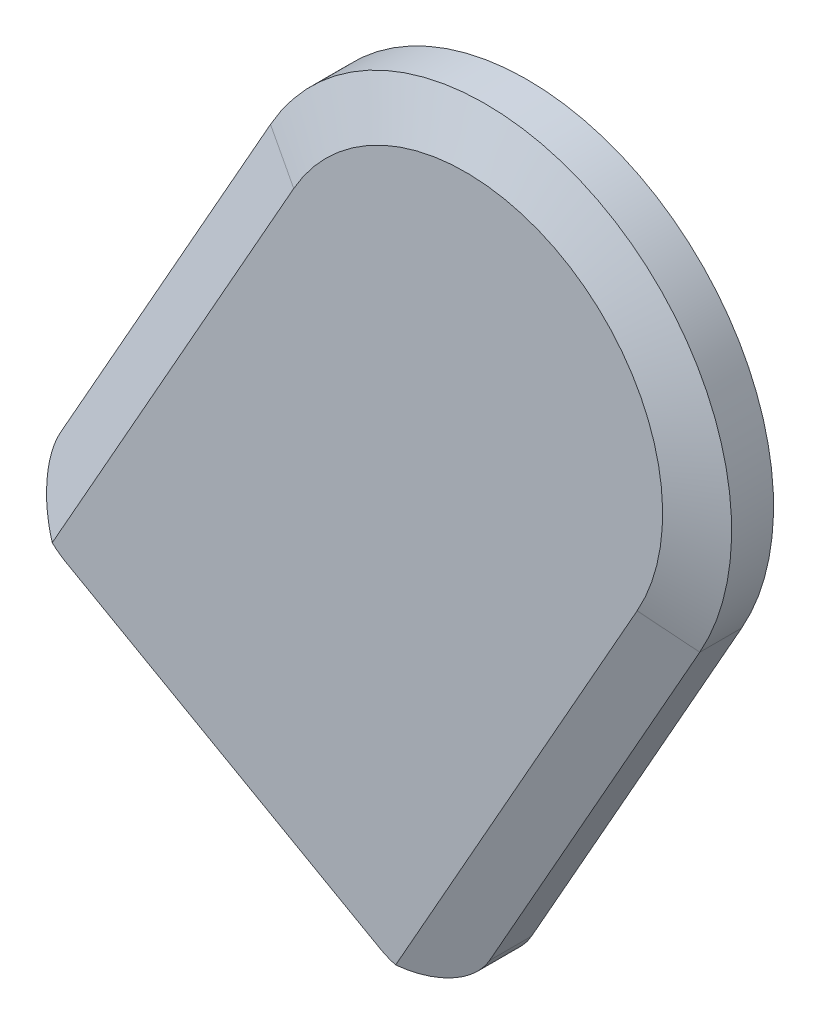
ISO-10303-21;
HEADER;
FILE_DESCRIPTION(('STEP AP214'),'2;1');
FILE_NAME('part.step','',(''),(''),'','','');
FILE_SCHEMA(('AUTOMOTIVE_DESIGN { 1 0 10303 214 1 1 1 1 }'));
ENDSEC;
DATA;
#1=APPLICATION_CONTEXT('core data for automotive mechanical design processes');
#2=APPLICATION_PROTOCOL_DEFINITION('international standard','automotive_design',2000,#1);
#3=PRODUCT_CONTEXT('',#1,'mechanical');
#4=PRODUCT('Part','Part','',(#3));
#5=PRODUCT_RELATED_PRODUCT_CATEGORY('part','',(#4));
#6=PRODUCT_DEFINITION_FORMATION('','',#4);
#7=PRODUCT_DEFINITION_CONTEXT('part definition',#1,'design');
#8=PRODUCT_DEFINITION('design','',#6,#7);
#9=PRODUCT_DEFINITION_SHAPE('','',#8);
#10=(LENGTH_UNIT() NAMED_UNIT(*) SI_UNIT(.MILLI.,.METRE.));
#11=(NAMED_UNIT(*) PLANE_ANGLE_UNIT() SI_UNIT($,.RADIAN.));
#12=(NAMED_UNIT(*) SI_UNIT($,.STERADIAN.) SOLID_ANGLE_UNIT());
#13=UNCERTAINTY_MEASURE_WITH_UNIT(LENGTH_MEASURE(1.E-05),#10,'distance_accuracy_value','');
#14=(GEOMETRIC_REPRESENTATION_CONTEXT(3) GLOBAL_UNCERTAINTY_ASSIGNED_CONTEXT((#13)) GLOBAL_UNIT_ASSIGNED_CONTEXT((#10,
#11,#12)) REPRESENTATION_CONTEXT('',''));
#15=CARTESIAN_POINT('',(0.,0.,0.));
#16=DIRECTION('',(0.,0.,1.));
#17=DIRECTION('',(1.,0.,0.));
#18=AXIS2_PLACEMENT_3D('',#15,#16,#17);
#19=CARTESIAN_POINT('',(0.,0.,4.7625));
#20=DIRECTION('',(0.,0.,-1.));
#21=DIRECTION('',(-1.,0.,0.));
#22=AXIS2_PLACEMENT_3D('',#19,#20,#21);
#23=CYLINDRICAL_SURFACE('',#22,19.05);
#24=DIRECTION('',(0.,0.,-1.));
#25=VECTOR('',#24,1.);
#26=CARTESIAN_POINT('',(-16.5860934980668,9.37037899304964,4.7625));
#27=LINE('',#26,#25);
#28=CARTESIAN_POINT('',(-16.5860934980668,9.37037899304964,3.2385));
#29=VERTEX_POINT('',#28);
#30=CARTESIAN_POINT('',(-16.5860934980668,9.37037899304964,0.));
#31=VERTEX_POINT('',#30);
#32=EDGE_CURVE('E107',#29,#31,#27,.T.);
#33=ORIENTED_EDGE('',*,*,#32,.F.);
#34=CARTESIAN_POINT('',(0.,0.,3.2385));
#35=DIRECTION('',(0.,0.,1.));
#36=DIRECTION('',(1.,0.,0.));
#37=AXIS2_PLACEMENT_3D('',#34,#35,#36);
#38=CIRCLE('',#37,19.05);
#39=CARTESIAN_POINT('',(16.5860934980668,-9.37037899304964,3.2385));
#40=VERTEX_POINT('',#39);
#41=EDGE_CURVE('E165',#29,#40,#38,.F.);
#42=ORIENTED_EDGE('',*,*,#41,.T.);
#43=DIRECTION('',(0.,0.,-1.));
#44=VECTOR('',#43,1.);
#45=CARTESIAN_POINT('',(16.5860934980668,-9.37037899304964,4.7625));
#46=LINE('',#45,#44);
#47=CARTESIAN_POINT('',(16.5860934980668,-9.37037899304964,0.));
#48=VERTEX_POINT('',#47);
#49=EDGE_CURVE('E119',#40,#48,#46,.T.);
#50=ORIENTED_EDGE('',*,*,#49,.T.);
#51=CARTESIAN_POINT('',(0.,0.,0.));
#52=DIRECTION('',(0.,0.,1.));
#53=DIRECTION('',(1.,0.,0.));
#54=AXIS2_PLACEMENT_3D('',#51,#52,#53);
#55=CIRCLE('',#54,19.05);
#56=EDGE_CURVE('E126',#48,#31,#55,.T.);
#57=ORIENTED_EDGE('',*,*,#56,.T.);
#58=EDGE_LOOP('',(#33,#42,#50,#57));
#59=FACE_BOUND('',#58,.T.);
#60=ADVANCED_FACE('F41',(#59),#23,.T.);
#61=CARTESIAN_POINT('',(-16.5860934980668,9.37037899304964,4.7625));
#62=DIRECTION('',(0.870661076014006,-0.491883411708642,0.));
#63=DIRECTION('',(0.491883411708642,0.870661076014006,0.));
#64=AXIS2_PLACEMENT_3D('',#61,#62,#63);
#65=PLANE('',#64);
#66=DIRECTION('',(-0.491883411708642,-0.870661076014006,0.));
#67=VECTOR('',#66,1.);
#68=CARTESIAN_POINT('',(-16.5860934980668,9.37037899304964,0.));
#69=LINE('',#68,#67);
#70=CARTESIAN_POINT('',(-32.8280837526862,-19.3788497369328,0.));
#71=VERTEX_POINT('',#70);
#72=EDGE_CURVE('E110',#31,#71,#69,.T.);
#73=ORIENTED_EDGE('',*,*,#72,.T.);
#74=DIRECTION('',(0.,0.,-1.));
#75=VECTOR('',#74,1.);
#76=CARTESIAN_POINT('',(-32.8280837526862,-19.3788497369328,4.7625));
#77=LINE('',#76,#75);
#78=CARTESIAN_POINT('',(-32.8280837526862,-19.3788497369328,3.2385));
#79=VERTEX_POINT('',#78);
#80=EDGE_CURVE('E183',#71,#79,#77,.F.);
#81=ORIENTED_EDGE('',*,*,#80,.T.);
#82=DIRECTION('',(0.491883411708642,0.870661076014006,0.));
#83=VECTOR('',#82,1.);
#84=CARTESIAN_POINT('',(-16.5860934980668,9.37037899304964,3.2385));
#85=LINE('',#84,#83);
#86=EDGE_CURVE('E113',#79,#29,#85,.T.);
#87=ORIENTED_EDGE('',*,*,#86,.T.);
#88=ORIENTED_EDGE('',*,*,#32,.T.);
#89=EDGE_LOOP('',(#73,#81,#87,#88));
#90=FACE_BOUND('',#89,.T.);
#91=ADVANCED_FACE('F109',(#90),#65,.F.);
#92=CARTESIAN_POINT('',(-35.3268514841661,-23.801808003084,4.7625));
#93=DIRECTION('',(0.491883411708639,0.870661076014008,0.));
#94=DIRECTION('',(-0.870661076014008,0.491883411708639,0.));
#95=AXIS2_PLACEMENT_3D('',#92,#93,#94);
#96=PLANE('',#95);
#97=DIRECTION('',(0.870661076014008,-0.491883411708639,0.));
#98=VECTOR('',#97,1.);
#99=CARTESIAN_POINT('',(-35.3268514841661,-23.801808003084,4.7625));
#100=LINE('',#99,#98);
#101=CARTESIAN_POINT('',(-30.9038932180149,-26.3005757345639,4.7625));
#102=VERTEX_POINT('',#101);
#103=CARTESIAN_POINT('',(-6.57762275418354,-40.0437982577033,4.7625));
#104=VERTEX_POINT('',#103);
#105=EDGE_CURVE('E141',#102,#104,#100,.T.);
#106=ORIENTED_EDGE('',*,*,#105,.F.);
#107=DIRECTION('',(0.,0.,-1.));
#108=VECTOR('',#107,1.);
#109=CARTESIAN_POINT('',(-30.9038932180149,-26.3005757345639,4.7625));
#110=LINE('',#109,#108);
#111=CARTESIAN_POINT('',(-30.9038932180149,-26.3005757345639,0.));
#112=VERTEX_POINT('',#111);
#113=EDGE_CURVE('E174',#102,#112,#110,.T.);
#114=ORIENTED_EDGE('',*,*,#113,.T.);
#115=DIRECTION('',(0.870661076014008,-0.491883411708639,0.));
#116=VECTOR('',#115,1.);
#117=CARTESIAN_POINT('',(-35.3268514841661,-23.801808003084,0.));
#118=LINE('',#117,#116);
#119=CARTESIAN_POINT('',(-6.57762275418354,-40.0437982577033,0.));
#120=VERTEX_POINT('',#119);
#121=EDGE_CURVE('E129',#112,#120,#118,.T.);
#122=ORIENTED_EDGE('',*,*,#121,.T.);
#123=DIRECTION('',(0.,0.,-1.));
#124=VECTOR('',#123,1.);
#125=CARTESIAN_POINT('',(-6.57762275418353,-40.0437982577033,4.7625));
#126=LINE('',#125,#124);
#127=EDGE_CURVE('E168',#120,#104,#126,.F.);
#128=ORIENTED_EDGE('',*,*,#127,.T.);
#129=EDGE_LOOP('',(#106,#114,#122,#128));
#130=FACE_BOUND('',#129,.T.);
#131=ADVANCED_FACE('F202',(#130),#96,.F.);
#132=CARTESIAN_POINT('',(16.5860934980668,-9.37037899304964,4.7625));
#133=DIRECTION('',(-0.870661076014006,0.491883411708642,0.));
#134=DIRECTION('',(-0.491883411708642,-0.870661076014006,0.));
#135=AXIS2_PLACEMENT_3D('',#132,#133,#134);
#136=PLANE('',#135);
#137=DIRECTION('',(-0.491883411708642,-0.870661076014006,0.));
#138=VECTOR('',#137,1.);
#139=CARTESIAN_POINT('',(-2.15466448803239,-42.5425659891831,3.2385));
#140=LINE('',#139,#138);
#141=CARTESIAN_POINT('',(0.344103243447504,-38.119607723032,3.2385));
#142=VERTEX_POINT('',#141);
#143=EDGE_CURVE('E160',#40,#142,#140,.T.);
#144=ORIENTED_EDGE('',*,*,#143,.T.);
#145=DIRECTION('',(0.,0.,-1.));
#146=VECTOR('',#145,1.);
#147=CARTESIAN_POINT('',(0.3441032434475,-38.119607723032,4.7625));
#148=LINE('',#147,#146);
#149=CARTESIAN_POINT('',(0.344103243447497,-38.119607723032,0.));
#150=VERTEX_POINT('',#149);
#151=EDGE_CURVE('E50',#142,#150,#148,.T.);
#152=ORIENTED_EDGE('',*,*,#151,.T.);
#153=DIRECTION('',(0.491883411708642,0.870661076014006,0.));
#154=VECTOR('',#153,1.);
#155=CARTESIAN_POINT('',(16.5860934980668,-9.37037899304964,0.));
#156=LINE('',#155,#154);
#157=EDGE_CURVE('E146',#150,#48,#156,.T.);
#158=ORIENTED_EDGE('',*,*,#157,.T.);
#159=ORIENTED_EDGE('',*,*,#49,.F.);
#160=EDGE_LOOP('',(#144,#152,#158,#159));
#161=FACE_BOUND('',#160,.T.);
#162=ADVANCED_FACE('F197',(#161),#136,.F.);
#163=CARTESIAN_POINT('',(0.,0.,4.7625));
#164=DIRECTION('',(0.,0.,1.));
#165=DIRECTION('',(1.,0.,0.));
#166=AXIS2_PLACEMENT_3D('',#163,#164,#165);
#167=PLANE('',#166);
#168=DIRECTION('',(-0.491883411708642,-0.870661076014006,0.));
#169=VECTOR('',#168,1.);
#170=CARTESIAN_POINT('',(-32.0096327845527,-25.6758838016939,4.7625));
#171=LINE('',#170,#169);
#172=CARTESIAN_POINT('',(-13.2688747984534,7.4963031944397,4.7625));
#173=VERTEX_POINT('',#172);
#174=CARTESIAN_POINT('',(-31.9302865055883,-25.5354364619862,4.7625));
#175=VERTEX_POINT('',#174);
#176=EDGE_CURVE('E153',#173,#175,#171,.T.);
#177=ORIENTED_EDGE('',*,*,#176,.T.);
#178=CARTESIAN_POINT('',(-28.405125486535,-21.8776174684127,4.7625));
#179=DIRECTION('',(0.,0.,1.));
#180=DIRECTION('',(1.,0.,0.));
#181=AXIS2_PLACEMENT_3D('',#178,#179,#180);
#182=CIRCLE('',#181,5.08);
#183=EDGE_CURVE('E191',#175,#102,#182,.T.);
#184=ORIENTED_EDGE('',*,*,#183,.T.);
#185=ORIENTED_EDGE('',*,*,#105,.T.);
#186=CARTESIAN_POINT('',(-4.07885502270365,-35.6208399915521,4.7625));
#187=DIRECTION('',(0.,0.,1.));
#188=DIRECTION('',(1.,0.,0.));
#189=AXIS2_PLACEMENT_3D('',#186,#187,#188);
#190=CIRCLE('',#189,5.08);
#191=CARTESIAN_POINT('',(-5.39253690868142,-40.5280428508655,4.7625));
#192=VERTEX_POINT('',#191);
#193=EDGE_CURVE('E63',#104,#192,#190,.T.);
#194=ORIENTED_EDGE('',*,*,#193,.T.);
#195=DIRECTION('',(0.491883411708642,0.870661076014006,0.));
#196=VECTOR('',#195,1.);
#197=CARTESIAN_POINT('',(13.2688747984534,-7.4963031944397,4.7625));
#198=LINE('',#197,#196);
#199=CARTESIAN_POINT('',(13.2688747984534,-7.4963031944397,4.7625));
#200=VERTEX_POINT('',#199);
#201=EDGE_CURVE('E157',#192,#200,#198,.T.);
#202=ORIENTED_EDGE('',*,*,#201,.T.);
#203=CARTESIAN_POINT('',(0.,0.,4.7625));
#204=DIRECTION('',(0.,0.,1.));
#205=DIRECTION('',(1.,0.,0.));
#206=AXIS2_PLACEMENT_3D('',#203,#204,#205);
#207=CIRCLE('',#206,15.24);
#208=EDGE_CURVE('E118',#200,#173,#207,.T.);
#209=ORIENTED_EDGE('',*,*,#208,.T.);
#210=EDGE_LOOP('',(#177,#184,#185,#194,#202,#209));
#211=FACE_BOUND('',#210,.T.);
#212=ADVANCED_FACE('F240',(#211),#167,.T.);
#213=CARTESIAN_POINT('',(0.,0.,0.));
#214=DIRECTION('',(0.,0.,1.));
#215=DIRECTION('',(1.,0.,0.));
#216=AXIS2_PLACEMENT_3D('',#213,#214,#215);
#217=PLANE('',#216);
#218=ORIENTED_EDGE('',*,*,#121,.F.);
#219=CARTESIAN_POINT('',(-28.405125486535,-21.8776174684127,0.));
#220=DIRECTION('',(0.,0.,1.));
#221=DIRECTION('',(1.,0.,0.));
#222=AXIS2_PLACEMENT_3D('',#219,#220,#221);
#223=CIRCLE('',#222,5.08);
#224=EDGE_CURVE('E127',#112,#71,#223,.F.);
#225=ORIENTED_EDGE('',*,*,#224,.T.);
#226=ORIENTED_EDGE('',*,*,#72,.F.);
#227=ORIENTED_EDGE('',*,*,#56,.F.);
#228=ORIENTED_EDGE('',*,*,#157,.F.);
#229=CARTESIAN_POINT('',(-4.07885502270365,-35.6208399915521,0.));
#230=DIRECTION('',(0.,0.,1.));
#231=DIRECTION('',(1.,0.,0.));
#232=AXIS2_PLACEMENT_3D('',#229,#230,#231);
#233=CIRCLE('',#232,5.08);
#234=EDGE_CURVE('E178',#150,#120,#233,.F.);
#235=ORIENTED_EDGE('',*,*,#234,.T.);
#236=EDGE_LOOP('',(#218,#225,#226,#227,#228,#235));
#237=FACE_BOUND('',#236,.T.);
#238=ADVANCED_FACE('F124',(#237),#217,.F.);
#239=CARTESIAN_POINT('',(-13.2688747984534,7.4963031944397,4.7625));
#240=DIRECTION('',(-0.323355405896031,0.182680912961836,0.92847669088526));
#241=DIRECTION('',(0.491883411708642,0.870661076014006,0.));
#242=AXIS2_PLACEMENT_3D('',#239,#240,#241);
#243=PLANE('',#242);
#244=ORIENTED_EDGE('',*,*,#86,.F.);
#245=CARTESIAN_POINT('',(-28.405125486535,-21.8776174684127,5.27049999999999));
#246=DIRECTION('',(-0.323355405896031,0.182680912961836,0.92847669088526));
#247=DIRECTION('',(-0.808388514740084,0.456702282404592,-0.371390676354102));
#248=AXIS2_PLACEMENT_3D('',#245,#246,#247);
#249=ELLIPSE('',#248,5.47132744404865,5.08);
#250=EDGE_CURVE('E186',#79,#175,#249,.T.);
#251=ORIENTED_EDGE('',*,*,#250,.T.);
#252=ORIENTED_EDGE('',*,*,#176,.F.);
#253=DIRECTION('',(0.808388514740084,-0.456702282404592,0.371390676354101));
#254=VECTOR('',#253,1.);
#255=CARTESIAN_POINT('',(-16.5860934980668,9.37037899304964,3.2385));
#256=LINE('',#255,#254);
#257=EDGE_CURVE('E134',#29,#173,#256,.T.);
#258=ORIENTED_EDGE('',*,*,#257,.F.);
#259=EDGE_LOOP('',(#244,#251,#252,#258));
#260=FACE_BOUND('',#259,.T.);
#261=ADVANCED_FACE('F231',(#260),#243,.T.);
#262=CARTESIAN_POINT('',(0.,0.,4.7625));
#263=DIRECTION('',(0.,0.,-1.));
#264=DIRECTION('',(-1.,0.,0.));
#265=AXIS2_PLACEMENT_3D('',#262,#263,#264);
#266=CONICAL_SURFACE('',#265,15.24,1.19028994968253);
#267=ORIENTED_EDGE('',*,*,#257,.T.);
#268=ORIENTED_EDGE('',*,*,#208,.F.);
#269=DIRECTION('',(-0.808388514740084,0.456702282404592,0.371390676354101));
#270=VECTOR('',#269,1.);
#271=CARTESIAN_POINT('',(16.5860934980668,-9.37037899304964,3.2385));
#272=LINE('',#271,#270);
#273=EDGE_CURVE('E138',#40,#200,#272,.T.);
#274=ORIENTED_EDGE('',*,*,#273,.F.);
#275=ORIENTED_EDGE('',*,*,#41,.F.);
#276=EDGE_LOOP('',(#267,#268,#274,#275));
#277=FACE_BOUND('',#276,.T.);
#278=ADVANCED_FACE('F225',(#277),#266,.T.);
#279=CARTESIAN_POINT('',(13.2688747984534,-7.4963031944397,4.7625));
#280=DIRECTION('',(0.323355405896031,-0.182680912961836,0.92847669088526));
#281=DIRECTION('',(-0.491883411708642,-0.870661076014006,0.));
#282=AXIS2_PLACEMENT_3D('',#279,#280,#281);
#283=PLANE('',#282);
#284=ORIENTED_EDGE('',*,*,#201,.F.);
#285=CARTESIAN_POINT('',(-4.07885502270365,-35.6208399915521,5.27049999999999));
#286=DIRECTION('',(0.323355405896031,-0.182680912961836,0.92847669088526));
#287=DIRECTION('',(0.808388514740084,-0.456702282404592,-0.371390676354102));
#288=AXIS2_PLACEMENT_3D('',#285,#286,#287);
#289=ELLIPSE('',#288,5.47132744404865,5.08);
#290=EDGE_CURVE('E11',#192,#142,#289,.T.);
#291=ORIENTED_EDGE('',*,*,#290,.T.);
#292=ORIENTED_EDGE('',*,*,#143,.F.);
#293=ORIENTED_EDGE('',*,*,#273,.T.);
#294=EDGE_LOOP('',(#284,#291,#292,#293));
#295=FACE_BOUND('',#294,.T.);
#296=ADVANCED_FACE('F209',(#295),#283,.T.);
#297=CARTESIAN_POINT('',(-28.405125486535,-21.8776174684127,4.7625));
#298=DIRECTION('',(0.,0.,-1.));
#299=DIRECTION('',(-1.,0.,0.));
#300=AXIS2_PLACEMENT_3D('',#297,#298,#299);
#301=CYLINDRICAL_SURFACE('',#300,5.08);
#302=ORIENTED_EDGE('',*,*,#250,.F.);
#303=ORIENTED_EDGE('',*,*,#80,.F.);
#304=ORIENTED_EDGE('',*,*,#224,.F.);
#305=ORIENTED_EDGE('',*,*,#113,.F.);
#306=ORIENTED_EDGE('',*,*,#183,.F.);
#307=EDGE_LOOP('',(#302,#303,#304,#305,#306));
#308=FACE_BOUND('',#307,.T.);
#309=ADVANCED_FACE('F205',(#308),#301,.T.);
#310=CARTESIAN_POINT('',(-4.07885502270365,-35.6208399915521,4.7625));
#311=DIRECTION('',(0.,0.,-1.));
#312=DIRECTION('',(-1.,0.,0.));
#313=AXIS2_PLACEMENT_3D('',#310,#311,#312);
#314=CYLINDRICAL_SURFACE('',#313,5.08);
#315=ORIENTED_EDGE('',*,*,#193,.F.);
#316=ORIENTED_EDGE('',*,*,#127,.F.);
#317=ORIENTED_EDGE('',*,*,#234,.F.);
#318=ORIENTED_EDGE('',*,*,#151,.F.);
#319=ORIENTED_EDGE('',*,*,#290,.F.);
#320=EDGE_LOOP('',(#315,#316,#317,#318,#319));
#321=FACE_BOUND('',#320,.T.);
#322=ADVANCED_FACE('F43',(#321),#314,.T.);
#323=CLOSED_SHELL('',(#60,#91,#131,#162,#212,#238,#261,#278,#296,#309,#322));
#324=MANIFOLD_SOLID_BREP('B2',#323);
#325=ADVANCED_BREP_SHAPE_REPRESENTATION('',(#18,#324),#14);
#326=SHAPE_DEFINITION_REPRESENTATION(#9,#325);
ENDSEC;
END-ISO-10303-21;
